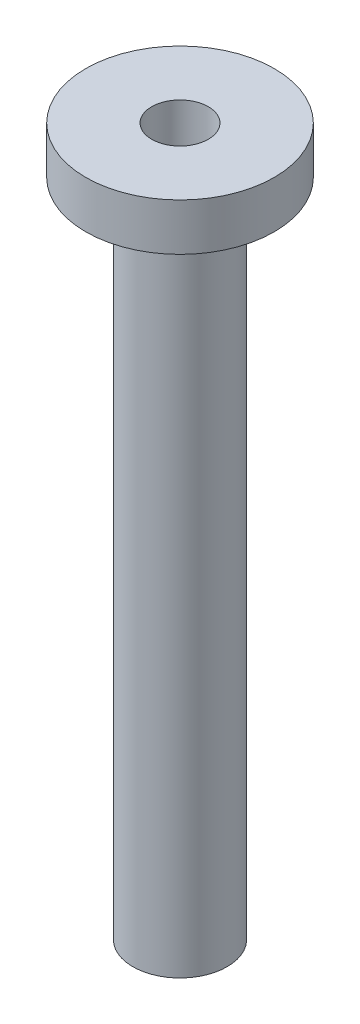
ISO-10303-21;
HEADER;
FILE_DESCRIPTION(('STEP AP214'),'2;1');
FILE_NAME('part.step','',(''),(''),'','','');
FILE_SCHEMA(('AUTOMOTIVE_DESIGN { 1 0 10303 214 1 1 1 1 }'));
ENDSEC;
DATA;
#1=APPLICATION_CONTEXT('core data for automotive mechanical design processes');
#2=APPLICATION_PROTOCOL_DEFINITION('international standard','automotive_design',2000,#1);
#3=PRODUCT_CONTEXT('',#1,'mechanical');
#4=PRODUCT('Part','Part','',(#3));
#5=PRODUCT_RELATED_PRODUCT_CATEGORY('part','',(#4));
#6=PRODUCT_DEFINITION_FORMATION('','',#4);
#7=PRODUCT_DEFINITION_CONTEXT('part definition',#1,'design');
#8=PRODUCT_DEFINITION('design','',#6,#7);
#9=PRODUCT_DEFINITION_SHAPE('','',#8);
#10=(LENGTH_UNIT() NAMED_UNIT(*) SI_UNIT(.MILLI.,.METRE.));
#11=(NAMED_UNIT(*) PLANE_ANGLE_UNIT() SI_UNIT($,.RADIAN.));
#12=(NAMED_UNIT(*) SI_UNIT($,.STERADIAN.) SOLID_ANGLE_UNIT());
#13=UNCERTAINTY_MEASURE_WITH_UNIT(LENGTH_MEASURE(1.E-05),#10,'distance_accuracy_value','');
#14=(GEOMETRIC_REPRESENTATION_CONTEXT(3) GLOBAL_UNCERTAINTY_ASSIGNED_CONTEXT((#13)) GLOBAL_UNIT_ASSIGNED_CONTEXT((#10,
#11,#12)) REPRESENTATION_CONTEXT('',''));
#15=CARTESIAN_POINT('',(0.,0.,0.));
#16=DIRECTION('',(0.,0.,1.));
#17=DIRECTION('',(1.,0.,0.));
#18=AXIS2_PLACEMENT_3D('',#15,#16,#17);
#19=CARTESIAN_POINT('',(0.,0.,0.));
#20=DIRECTION('',(0.,-1.,0.));
#21=DIRECTION('',(1.,0.,0.));
#22=AXIS2_PLACEMENT_3D('',#19,#20,#21);
#23=CYLINDRICAL_SURFACE('',#22,3.81000000000001);
#24=CARTESIAN_POINT('',(0.,92.71,0.));
#25=DIRECTION('',(0.,-1.,0.));
#26=DIRECTION('',(1.,0.,0.));
#27=AXIS2_PLACEMENT_3D('',#24,#25,#26);
#28=CIRCLE('',#27,3.81000000000001);
#29=CARTESIAN_POINT('',(3.81000000000001,92.71,0.));
#30=VERTEX_POINT('',#29);
#31=EDGE_CURVE('E80',#30,#30,#28,.T.);
#32=ORIENTED_EDGE('',*,*,#31,.F.);
#33=EDGE_LOOP('',(#32));
#34=FACE_BOUND('',#33,.T.);
#35=CARTESIAN_POINT('',(0.,0.,0.));
#36=DIRECTION('',(0.,-1.,0.));
#37=DIRECTION('',(1.,0.,0.));
#38=AXIS2_PLACEMENT_3D('',#35,#36,#37);
#39=CIRCLE('',#38,3.81);
#40=CARTESIAN_POINT('',(3.81,0.,0.));
#41=VERTEX_POINT('',#40);
#42=EDGE_CURVE('E10',#41,#41,#39,.T.);
#43=ORIENTED_EDGE('',*,*,#42,.T.);
#44=EDGE_LOOP('',(#43));
#45=FACE_BOUND('',#44,.T.);
#46=ADVANCED_FACE('F37',(#34,#45),#23,.F.);
#47=CARTESIAN_POINT('',(0.,-2.54000000000003,0.));
#48=DIRECTION('',(0.,-1.,0.));
#49=DIRECTION('',(1.,0.,0.));
#50=AXIS2_PLACEMENT_3D('',#47,#48,#49);
#51=CONICAL_SURFACE('',#50,6.35,0.785398163397443);
#52=ORIENTED_EDGE('',*,*,#42,.F.);
#53=EDGE_LOOP('',(#52));
#54=FACE_BOUND('',#53,.T.);
#55=CARTESIAN_POINT('',(0.,-2.54000000000003,0.));
#56=DIRECTION('',(0.,-1.,0.));
#57=DIRECTION('',(1.,0.,0.));
#58=AXIS2_PLACEMENT_3D('',#55,#56,#57);
#59=CIRCLE('',#58,6.35);
#60=CARTESIAN_POINT('',(6.35,-2.54000000000003,0.));
#61=VERTEX_POINT('',#60);
#62=EDGE_CURVE('E44',#61,#61,#59,.T.);
#63=ORIENTED_EDGE('',*,*,#62,.T.);
#64=EDGE_LOOP('',(#63));
#65=FACE_BOUND('',#64,.T.);
#66=ADVANCED_FACE('F88',(#54,#65),#51,.F.);
#67=CARTESIAN_POINT('',(0.,0.,0.));
#68=DIRECTION('',(0.,-1.,0.));
#69=DIRECTION('',(1.,0.,0.));
#70=AXIS2_PLACEMENT_3D('',#67,#68,#69);
#71=CYLINDRICAL_SURFACE('',#70,6.35);
#72=ORIENTED_EDGE('',*,*,#62,.F.);
#73=EDGE_LOOP('',(#72));
#74=FACE_BOUND('',#73,.T.);
#75=CARTESIAN_POINT('',(0.,86.36,0.));
#76=DIRECTION('',(0.,-1.,0.));
#77=DIRECTION('',(1.,0.,0.));
#78=AXIS2_PLACEMENT_3D('',#75,#76,#77);
#79=CIRCLE('',#78,6.35);
#80=CARTESIAN_POINT('',(6.35,86.36,0.));
#81=VERTEX_POINT('',#80);
#82=EDGE_CURVE('E49',#81,#81,#79,.T.);
#83=ORIENTED_EDGE('',*,*,#82,.T.);
#84=EDGE_LOOP('',(#83));
#85=FACE_BOUND('',#84,.T.);
#86=ADVANCED_FACE('F92',(#74,#85),#71,.T.);
#87=CARTESIAN_POINT('',(-6.35,86.36,0.));
#88=DIRECTION('',(0.,1.,0.));
#89=DIRECTION('',(-1.,0.,0.));
#90=AXIS2_PLACEMENT_3D('',#87,#88,#89);
#91=PLANE('',#90);
#92=ORIENTED_EDGE('',*,*,#82,.F.);
#93=EDGE_LOOP('',(#92));
#94=FACE_BOUND('',#93,.T.);
#95=CARTESIAN_POINT('',(0.,86.36,0.));
#96=DIRECTION('',(0.,-1.,0.));
#97=DIRECTION('',(1.,0.,0.));
#98=AXIS2_PLACEMENT_3D('',#95,#96,#97);
#99=CIRCLE('',#98,7.9375);
#100=CARTESIAN_POINT('',(7.9375,86.36,0.));
#101=VERTEX_POINT('',#100);
#102=EDGE_CURVE('E54',#101,#101,#99,.T.);
#103=ORIENTED_EDGE('',*,*,#102,.T.);
#104=EDGE_LOOP('',(#103));
#105=FACE_BOUND('',#104,.T.);
#106=ADVANCED_FACE('F97',(#94,#105),#91,.F.);
#107=CARTESIAN_POINT('',(0.,0.,0.));
#108=DIRECTION('',(0.,-1.,0.));
#109=DIRECTION('',(1.,0.,0.));
#110=AXIS2_PLACEMENT_3D('',#107,#108,#109);
#111=CYLINDRICAL_SURFACE('',#110,7.9375);
#112=ORIENTED_EDGE('',*,*,#102,.F.);
#113=EDGE_LOOP('',(#112));
#114=FACE_BOUND('',#113,.T.);
#115=CARTESIAN_POINT('',(0.,88.392,0.));
#116=DIRECTION('',(0.,-1.,0.));
#117=DIRECTION('',(1.,0.,0.));
#118=AXIS2_PLACEMENT_3D('',#115,#116,#117);
#119=CIRCLE('',#118,7.9375);
#120=CARTESIAN_POINT('',(7.9375,88.392,0.));
#121=VERTEX_POINT('',#120);
#122=EDGE_CURVE('E60',#121,#121,#119,.T.);
#123=ORIENTED_EDGE('',*,*,#122,.T.);
#124=EDGE_LOOP('',(#123));
#125=FACE_BOUND('',#124,.T.);
#126=ADVANCED_FACE('F103',(#114,#125),#111,.T.);
#127=CARTESIAN_POINT('',(-7.9375,88.392,0.));
#128=DIRECTION('',(0.,1.,0.));
#129=DIRECTION('',(-1.,0.,0.));
#130=AXIS2_PLACEMENT_3D('',#127,#128,#129);
#131=PLANE('',#130);
#132=ORIENTED_EDGE('',*,*,#122,.F.);
#133=EDGE_LOOP('',(#132));
#134=FACE_BOUND('',#133,.T.);
#135=CARTESIAN_POINT('',(0.,88.392,0.));
#136=DIRECTION('',(0.,-1.,0.));
#137=DIRECTION('',(1.,0.,0.));
#138=AXIS2_PLACEMENT_3D('',#135,#136,#137);
#139=CIRCLE('',#138,10.9855);
#140=CARTESIAN_POINT('',(10.9855,88.392,0.));
#141=VERTEX_POINT('',#140);
#142=EDGE_CURVE('E64',#141,#141,#139,.T.);
#143=ORIENTED_EDGE('',*,*,#142,.T.);
#144=EDGE_LOOP('',(#143));
#145=FACE_BOUND('',#144,.T.);
#146=ADVANCED_FACE('F107',(#134,#145),#131,.F.);
#147=CARTESIAN_POINT('',(0.,0.,0.));
#148=DIRECTION('',(0.,-1.,0.));
#149=DIRECTION('',(1.,0.,0.));
#150=AXIS2_PLACEMENT_3D('',#147,#148,#149);
#151=CYLINDRICAL_SURFACE('',#150,10.9855);
#152=ORIENTED_EDGE('',*,*,#142,.F.);
#153=EDGE_LOOP('',(#152));
#154=FACE_BOUND('',#153,.T.);
#155=CARTESIAN_POINT('',(0.,86.36,0.));
#156=DIRECTION('',(0.,-1.,0.));
#157=DIRECTION('',(1.,0.,0.));
#158=AXIS2_PLACEMENT_3D('',#155,#156,#157);
#159=CIRCLE('',#158,10.9855);
#160=CARTESIAN_POINT('',(10.9855,86.36,0.));
#161=VERTEX_POINT('',#160);
#162=EDGE_CURVE('E68',#161,#161,#159,.T.);
#163=ORIENTED_EDGE('',*,*,#162,.T.);
#164=EDGE_LOOP('',(#163));
#165=FACE_BOUND('',#164,.T.);
#166=ADVANCED_FACE('F111',(#154,#165),#151,.F.);
#167=CARTESIAN_POINT('',(-10.9855,86.36,0.));
#168=DIRECTION('',(0.,1.,0.));
#169=DIRECTION('',(-1.,0.,0.));
#170=AXIS2_PLACEMENT_3D('',#167,#168,#169);
#171=PLANE('',#170);
#172=ORIENTED_EDGE('',*,*,#162,.F.);
#173=EDGE_LOOP('',(#172));
#174=FACE_BOUND('',#173,.T.);
#175=CARTESIAN_POINT('',(0.,86.36,0.));
#176=DIRECTION('',(0.,-1.,0.));
#177=DIRECTION('',(1.,0.,0.));
#178=AXIS2_PLACEMENT_3D('',#175,#176,#177);
#179=CIRCLE('',#178,12.7);
#180=CARTESIAN_POINT('',(12.7,86.36,0.));
#181=VERTEX_POINT('',#180);
#182=EDGE_CURVE('E72',#181,#181,#179,.T.);
#183=ORIENTED_EDGE('',*,*,#182,.T.);
#184=EDGE_LOOP('',(#183));
#185=FACE_BOUND('',#184,.T.);
#186=ADVANCED_FACE('F115',(#174,#185),#171,.F.);
#187=CARTESIAN_POINT('',(0.,0.,0.));
#188=DIRECTION('',(0.,-1.,0.));
#189=DIRECTION('',(1.,0.,0.));
#190=AXIS2_PLACEMENT_3D('',#187,#188,#189);
#191=CYLINDRICAL_SURFACE('',#190,12.7);
#192=ORIENTED_EDGE('',*,*,#182,.F.);
#193=EDGE_LOOP('',(#192));
#194=FACE_BOUND('',#193,.T.);
#195=CARTESIAN_POINT('',(0.,92.71,0.));
#196=DIRECTION('',(0.,-1.,0.));
#197=DIRECTION('',(1.,0.,0.));
#198=AXIS2_PLACEMENT_3D('',#195,#196,#197);
#199=CIRCLE('',#198,12.7);
#200=CARTESIAN_POINT('',(12.7,92.71,0.));
#201=VERTEX_POINT('',#200);
#202=EDGE_CURVE('E76',#201,#201,#199,.T.);
#203=ORIENTED_EDGE('',*,*,#202,.T.);
#204=EDGE_LOOP('',(#203));
#205=FACE_BOUND('',#204,.T.);
#206=ADVANCED_FACE('F119',(#194,#205),#191,.T.);
#207=CARTESIAN_POINT('',(-12.7,92.71,0.));
#208=DIRECTION('',(0.,-1.,0.));
#209=DIRECTION('',(1.,0.,0.));
#210=AXIS2_PLACEMENT_3D('',#207,#208,#209);
#211=PLANE('',#210);
#212=ORIENTED_EDGE('',*,*,#202,.F.);
#213=EDGE_LOOP('',(#212));
#214=FACE_BOUND('',#213,.T.);
#215=ORIENTED_EDGE('',*,*,#31,.T.);
#216=EDGE_LOOP('',(#215));
#217=FACE_BOUND('',#216,.T.);
#218=ADVANCED_FACE('F85',(#214,#217),#211,.F.);
#219=CLOSED_SHELL('',(#46,#66,#86,#106,#126,#146,#166,#186,#206,#218));
#220=MANIFOLD_SOLID_BREP('B2',#219);
#221=ADVANCED_BREP_SHAPE_REPRESENTATION('',(#18,#220),#14);
#222=SHAPE_DEFINITION_REPRESENTATION(#9,#221);
ENDSEC;
END-ISO-10303-21;
